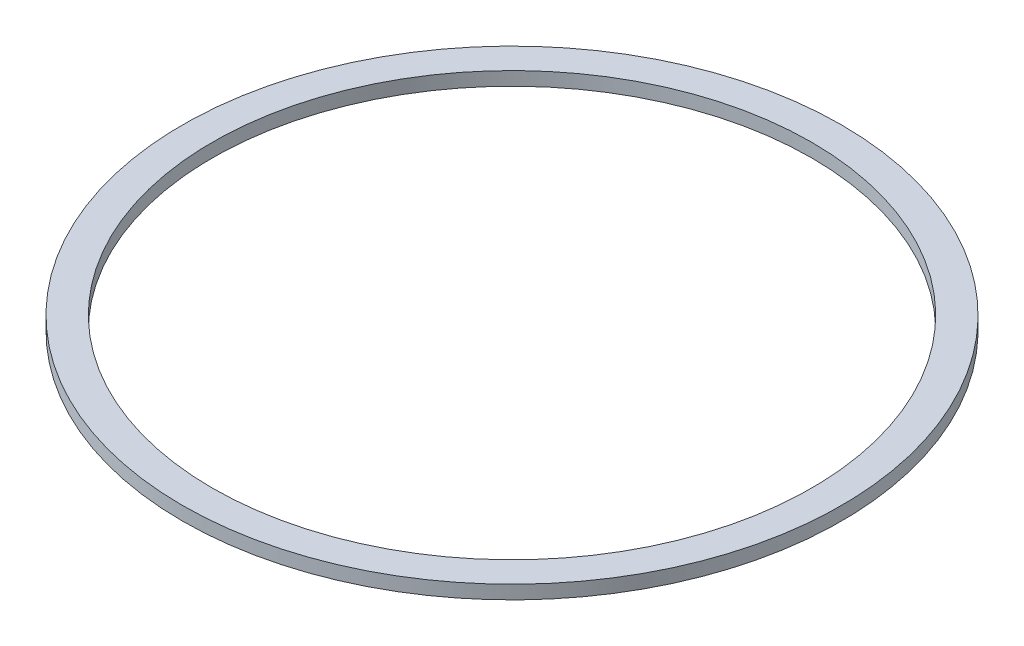
ISO-10303-21;
HEADER;
FILE_DESCRIPTION(('STEP AP214'),'2;1');
FILE_NAME('part.step','',(''),(''),'','','');
FILE_SCHEMA(('AUTOMOTIVE_DESIGN { 1 0 10303 214 1 1 1 1 }'));
ENDSEC;
DATA;
#1=APPLICATION_CONTEXT('core data for automotive mechanical design processes');
#2=APPLICATION_PROTOCOL_DEFINITION('international standard','automotive_design',2000,#1);
#3=PRODUCT_CONTEXT('',#1,'mechanical');
#4=PRODUCT('Part','Part','',(#3));
#5=PRODUCT_RELATED_PRODUCT_CATEGORY('part','',(#4));
#6=PRODUCT_DEFINITION_FORMATION('','',#4);
#7=PRODUCT_DEFINITION_CONTEXT('part definition',#1,'design');
#8=PRODUCT_DEFINITION('design','',#6,#7);
#9=PRODUCT_DEFINITION_SHAPE('','',#8);
#10=(LENGTH_UNIT() NAMED_UNIT(*) SI_UNIT(.MILLI.,.METRE.));
#11=(NAMED_UNIT(*) PLANE_ANGLE_UNIT() SI_UNIT($,.RADIAN.));
#12=(NAMED_UNIT(*) SI_UNIT($,.STERADIAN.) SOLID_ANGLE_UNIT());
#13=UNCERTAINTY_MEASURE_WITH_UNIT(LENGTH_MEASURE(1.E-05),#10,'distance_accuracy_value','');
#14=(GEOMETRIC_REPRESENTATION_CONTEXT(3) GLOBAL_UNCERTAINTY_ASSIGNED_CONTEXT((#13)) GLOBAL_UNIT_ASSIGNED_CONTEXT((#10,
#11,#12)) REPRESENTATION_CONTEXT('',''));
#15=CARTESIAN_POINT('',(0.,0.,0.));
#16=DIRECTION('',(0.,0.,1.));
#17=DIRECTION('',(1.,0.,0.));
#18=AXIS2_PLACEMENT_3D('',#15,#16,#17);
#19=CARTESIAN_POINT('',(0.,1.7272,0.));
#20=DIRECTION('',(0.,1.,0.));
#21=DIRECTION('',(0.,0.,1.));
#22=AXIS2_PLACEMENT_3D('',#19,#20,#21);
#23=PLANE('',#22);
#24=CARTESIAN_POINT('',(0.,1.7272,0.));
#25=DIRECTION('',(0.,1.,0.));
#26=DIRECTION('',(0.,0.,1.));
#27=AXIS2_PLACEMENT_3D('',#24,#25,#26);
#28=CIRCLE('',#27,41.91);
#29=CARTESIAN_POINT('',(0.,1.7272,41.91));
#30=VERTEX_POINT('',#29);
#31=EDGE_CURVE('E10',#30,#30,#28,.T.);
#32=ORIENTED_EDGE('',*,*,#31,.T.);
#33=EDGE_LOOP('',(#32));
#34=FACE_BOUND('',#33,.T.);
#35=CARTESIAN_POINT('',(0.,1.7272,0.));
#36=DIRECTION('',(0.,1.,0.));
#37=DIRECTION('',(0.,0.,1.));
#38=AXIS2_PLACEMENT_3D('',#35,#36,#37);
#39=CIRCLE('',#38,38.1);
#40=CARTESIAN_POINT('',(0.,1.7272,38.1));
#41=VERTEX_POINT('',#40);
#42=EDGE_CURVE('E42',#41,#41,#39,.T.);
#43=ORIENTED_EDGE('',*,*,#42,.F.);
#44=EDGE_LOOP('',(#43));
#45=FACE_BOUND('',#44,.T.);
#46=ADVANCED_FACE('F31',(#34,#45),#23,.T.);
#47=CARTESIAN_POINT('',(0.,0.,0.));
#48=DIRECTION('',(0.,1.,0.));
#49=DIRECTION('',(0.,0.,1.));
#50=AXIS2_PLACEMENT_3D('',#47,#48,#49);
#51=PLANE('',#50);
#52=CARTESIAN_POINT('',(0.,0.,0.));
#53=DIRECTION('',(0.,1.,0.));
#54=DIRECTION('',(0.,0.,1.));
#55=AXIS2_PLACEMENT_3D('',#52,#53,#54);
#56=CIRCLE('',#55,41.91);
#57=CARTESIAN_POINT('',(0.,0.,41.91));
#58=VERTEX_POINT('',#57);
#59=EDGE_CURVE('E35',#58,#58,#56,.T.);
#60=ORIENTED_EDGE('',*,*,#59,.F.);
#61=EDGE_LOOP('',(#60));
#62=FACE_BOUND('',#61,.T.);
#63=CARTESIAN_POINT('',(0.,0.,0.));
#64=DIRECTION('',(0.,1.,0.));
#65=DIRECTION('',(0.,0.,1.));
#66=AXIS2_PLACEMENT_3D('',#63,#64,#65);
#67=CIRCLE('',#66,38.1);
#68=CARTESIAN_POINT('',(0.,0.,38.1));
#69=VERTEX_POINT('',#68);
#70=EDGE_CURVE('E44',#69,#69,#67,.T.);
#71=ORIENTED_EDGE('',*,*,#70,.T.);
#72=EDGE_LOOP('',(#71));
#73=FACE_BOUND('',#72,.T.);
#74=ADVANCED_FACE('F54',(#62,#73),#51,.F.);
#75=CARTESIAN_POINT('',(0.,1.7272,0.));
#76=DIRECTION('',(0.,-1.,0.));
#77=DIRECTION('',(0.,0.,-1.));
#78=AXIS2_PLACEMENT_3D('',#75,#76,#77);
#79=CYLINDRICAL_SURFACE('',#78,41.91);
#80=ORIENTED_EDGE('',*,*,#31,.F.);
#81=EDGE_LOOP('',(#80));
#82=FACE_BOUND('',#81,.T.);
#83=ORIENTED_EDGE('',*,*,#59,.T.);
#84=EDGE_LOOP('',(#83));
#85=FACE_BOUND('',#84,.T.);
#86=ADVANCED_FACE('F33',(#82,#85),#79,.T.);
#87=CARTESIAN_POINT('',(0.,1.7272,0.));
#88=DIRECTION('',(0.,-1.,0.));
#89=DIRECTION('',(0.,0.,-1.));
#90=AXIS2_PLACEMENT_3D('',#87,#88,#89);
#91=CYLINDRICAL_SURFACE('',#90,38.1);
#92=ORIENTED_EDGE('',*,*,#42,.T.);
#93=EDGE_LOOP('',(#92));
#94=FACE_BOUND('',#93,.T.);
#95=ORIENTED_EDGE('',*,*,#70,.F.);
#96=EDGE_LOOP('',(#95));
#97=FACE_BOUND('',#96,.T.);
#98=ADVANCED_FACE('F50',(#94,#97),#91,.F.);
#99=CLOSED_SHELL('',(#46,#74,#86,#98));
#100=MANIFOLD_SOLID_BREP('B2',#99);
#101=ADVANCED_BREP_SHAPE_REPRESENTATION('',(#18,#100),#14);
#102=SHAPE_DEFINITION_REPRESENTATION(#9,#101);
ENDSEC;
END-ISO-10303-21;
